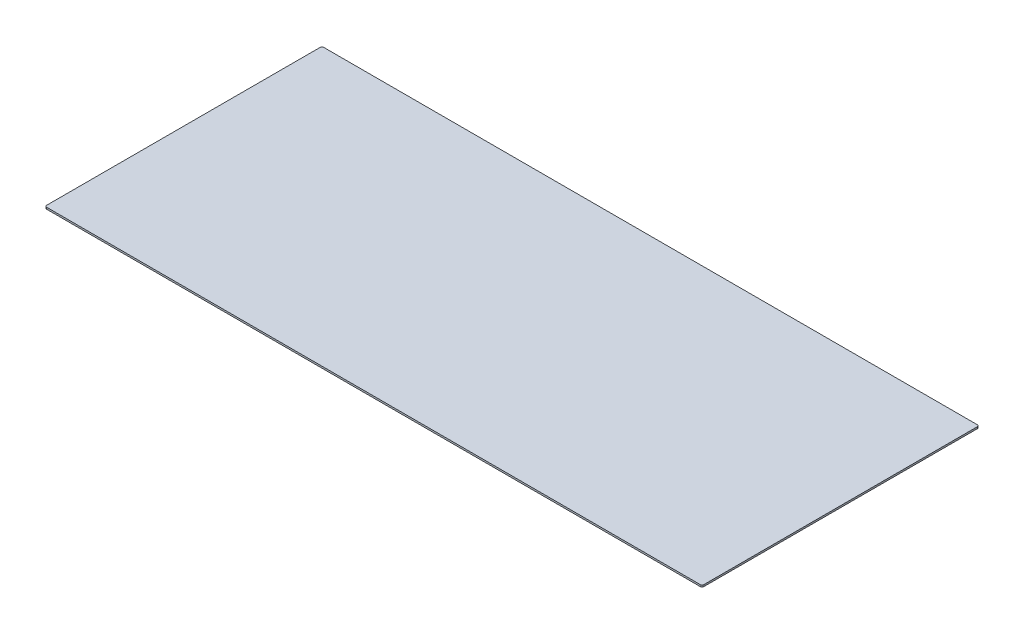
ISO-10303-21;
HEADER;
FILE_DESCRIPTION(('STEP AP214'),'2;1');
FILE_NAME('part.step','',(''),(''),'','','');
FILE_SCHEMA(('AUTOMOTIVE_DESIGN { 1 0 10303 214 1 1 1 1 }'));
ENDSEC;
DATA;
#1=APPLICATION_CONTEXT('core data for automotive mechanical design processes');
#2=APPLICATION_PROTOCOL_DEFINITION('international standard','automotive_design',2000,#1);
#3=PRODUCT_CONTEXT('',#1,'mechanical');
#4=PRODUCT('Part','Part','',(#3));
#5=PRODUCT_RELATED_PRODUCT_CATEGORY('part','',(#4));
#6=PRODUCT_DEFINITION_FORMATION('','',#4);
#7=PRODUCT_DEFINITION_CONTEXT('part definition',#1,'design');
#8=PRODUCT_DEFINITION('design','',#6,#7);
#9=PRODUCT_DEFINITION_SHAPE('','',#8);
#10=(LENGTH_UNIT() NAMED_UNIT(*) SI_UNIT(.MILLI.,.METRE.));
#11=(NAMED_UNIT(*) PLANE_ANGLE_UNIT() SI_UNIT($,.RADIAN.));
#12=(NAMED_UNIT(*) SI_UNIT($,.STERADIAN.) SOLID_ANGLE_UNIT());
#13=UNCERTAINTY_MEASURE_WITH_UNIT(LENGTH_MEASURE(1.E-05),#10,'distance_accuracy_value','');
#14=(GEOMETRIC_REPRESENTATION_CONTEXT(3) GLOBAL_UNCERTAINTY_ASSIGNED_CONTEXT((#13)) GLOBAL_UNIT_ASSIGNED_CONTEXT((#10,
#11,#12)) REPRESENTATION_CONTEXT('',''));
#15=CARTESIAN_POINT('',(0.,0.,0.));
#16=DIRECTION('',(0.,0.,1.));
#17=DIRECTION('',(1.,0.,0.));
#18=AXIS2_PLACEMENT_3D('',#15,#16,#17);
#19=CARTESIAN_POINT('',(587.375,3.175,-245.745));
#20=DIRECTION('',(0.,-1.,0.));
#21=DIRECTION('',(0.,0.,-1.));
#22=AXIS2_PLACEMENT_3D('',#19,#20,#21);
#23=CYLINDRICAL_SURFACE('',#22,3.17500000000003);
#24=CARTESIAN_POINT('',(587.375,0.,-245.745));
#25=DIRECTION('',(0.,1.,0.));
#26=DIRECTION('',(0.,0.,-1.));
#27=AXIS2_PLACEMENT_3D('',#24,#25,#26);
#28=CIRCLE('',#27,3.17500000000003);
#29=CARTESIAN_POINT('',(590.55,0.,-245.745));
#30=VERTEX_POINT('',#29);
#31=CARTESIAN_POINT('',(587.375,0.,-248.92));
#32=VERTEX_POINT('',#31);
#33=EDGE_CURVE('E133',#30,#32,#28,.T.);
#34=ORIENTED_EDGE('',*,*,#33,.T.);
#35=DIRECTION('',(0.,-1.,0.));
#36=VECTOR('',#35,1.);
#37=CARTESIAN_POINT('',(587.375,3.175,-248.92));
#38=LINE('',#37,#36);
#39=CARTESIAN_POINT('',(587.375,3.175,-248.92));
#40=VERTEX_POINT('',#39);
#41=EDGE_CURVE('E11',#40,#32,#38,.T.);
#42=ORIENTED_EDGE('',*,*,#41,.F.);
#43=CARTESIAN_POINT('',(587.375,3.175,-245.745));
#44=DIRECTION('',(0.,1.,0.));
#45=DIRECTION('',(0.,0.,-1.));
#46=AXIS2_PLACEMENT_3D('',#43,#44,#45);
#47=CIRCLE('',#46,3.17500000000003);
#48=CARTESIAN_POINT('',(590.55,3.175,-245.745));
#49=VERTEX_POINT('',#48);
#50=EDGE_CURVE('E147',#49,#40,#47,.T.);
#51=ORIENTED_EDGE('',*,*,#50,.F.);
#52=DIRECTION('',(0.,-1.,0.));
#53=VECTOR('',#52,1.);
#54=CARTESIAN_POINT('',(590.55,3.175,-245.745));
#55=LINE('',#54,#53);
#56=EDGE_CURVE('E129',#49,#30,#55,.T.);
#57=ORIENTED_EDGE('',*,*,#56,.T.);
#58=EDGE_LOOP('',(#34,#42,#51,#57));
#59=FACE_BOUND('',#58,.T.);
#60=ADVANCED_FACE('F37',(#59),#23,.T.);
#61=CARTESIAN_POINT('',(-587.375,3.175,-248.92));
#62=DIRECTION('',(0.,0.,1.));
#63=DIRECTION('',(1.,0.,0.));
#64=AXIS2_PLACEMENT_3D('',#61,#62,#63);
#65=PLANE('',#64);
#66=DIRECTION('',(-1.,0.,0.));
#67=VECTOR('',#66,1.);
#68=CARTESIAN_POINT('',(-587.375,0.,-248.92));
#69=LINE('',#68,#67);
#70=CARTESIAN_POINT('',(-587.375,0.,-248.92));
#71=VERTEX_POINT('',#70);
#72=EDGE_CURVE('E136',#32,#71,#69,.T.);
#73=ORIENTED_EDGE('',*,*,#72,.T.);
#74=DIRECTION('',(0.,-1.,0.));
#75=VECTOR('',#74,1.);
#76=CARTESIAN_POINT('',(-587.375,3.175,-248.92));
#77=LINE('',#76,#75);
#78=CARTESIAN_POINT('',(-587.375,3.175,-248.92));
#79=VERTEX_POINT('',#78);
#80=EDGE_CURVE('E45',#79,#71,#77,.T.);
#81=ORIENTED_EDGE('',*,*,#80,.F.);
#82=DIRECTION('',(-1.,0.,0.));
#83=VECTOR('',#82,1.);
#84=CARTESIAN_POINT('',(-587.375,3.175,-248.92));
#85=LINE('',#84,#83);
#86=EDGE_CURVE('E96',#40,#79,#85,.T.);
#87=ORIENTED_EDGE('',*,*,#86,.F.);
#88=ORIENTED_EDGE('',*,*,#41,.T.);
#89=EDGE_LOOP('',(#73,#81,#87,#88));
#90=FACE_BOUND('',#89,.T.);
#91=ADVANCED_FACE('F182',(#90),#65,.F.);
#92=CARTESIAN_POINT('',(-587.375,3.175,-245.745));
#93=DIRECTION('',(0.,-1.,0.));
#94=DIRECTION('',(0.,0.,-1.));
#95=AXIS2_PLACEMENT_3D('',#92,#93,#94);
#96=CYLINDRICAL_SURFACE('',#95,3.17500000000003);
#97=CARTESIAN_POINT('',(-587.375,0.,-245.745));
#98=DIRECTION('',(0.,1.,0.));
#99=DIRECTION('',(0.,0.,-1.));
#100=AXIS2_PLACEMENT_3D('',#97,#98,#99);
#101=CIRCLE('',#100,3.17500000000003);
#102=CARTESIAN_POINT('',(-590.55,0.,-245.745));
#103=VERTEX_POINT('',#102);
#104=EDGE_CURVE('E138',#71,#103,#101,.T.);
#105=ORIENTED_EDGE('',*,*,#104,.T.);
#106=DIRECTION('',(0.,-1.,0.));
#107=VECTOR('',#106,1.);
#108=CARTESIAN_POINT('',(-590.55,3.175,-245.745));
#109=LINE('',#108,#107);
#110=CARTESIAN_POINT('',(-590.55,3.175,-245.745));
#111=VERTEX_POINT('',#110);
#112=EDGE_CURVE('E154',#111,#103,#109,.T.);
#113=ORIENTED_EDGE('',*,*,#112,.F.);
#114=CARTESIAN_POINT('',(-587.375,3.175,-245.745));
#115=DIRECTION('',(0.,1.,0.));
#116=DIRECTION('',(0.,0.,-1.));
#117=AXIS2_PLACEMENT_3D('',#114,#115,#116);
#118=CIRCLE('',#117,3.17500000000003);
#119=EDGE_CURVE('E162',#79,#111,#118,.T.);
#120=ORIENTED_EDGE('',*,*,#119,.F.);
#121=ORIENTED_EDGE('',*,*,#80,.T.);
#122=EDGE_LOOP('',(#105,#113,#120,#121));
#123=FACE_BOUND('',#122,.T.);
#124=ADVANCED_FACE('F160',(#123),#96,.T.);
#125=CARTESIAN_POINT('',(-590.55,3.175,245.745));
#126=DIRECTION('',(1.,0.,0.));
#127=DIRECTION('',(0.,0.,-1.));
#128=AXIS2_PLACEMENT_3D('',#125,#126,#127);
#129=PLANE('',#128);
#130=DIRECTION('',(0.,0.,1.));
#131=VECTOR('',#130,1.);
#132=CARTESIAN_POINT('',(-590.55,0.,245.745));
#133=LINE('',#132,#131);
#134=CARTESIAN_POINT('',(-590.55,0.,245.745));
#135=VERTEX_POINT('',#134);
#136=EDGE_CURVE('E140',#103,#135,#133,.T.);
#137=ORIENTED_EDGE('',*,*,#136,.T.);
#138=DIRECTION('',(0.,-1.,0.));
#139=VECTOR('',#138,1.);
#140=CARTESIAN_POINT('',(-590.55,3.175,245.745));
#141=LINE('',#140,#139);
#142=CARTESIAN_POINT('',(-590.55,3.175,245.745));
#143=VERTEX_POINT('',#142);
#144=EDGE_CURVE('E151',#143,#135,#141,.T.);
#145=ORIENTED_EDGE('',*,*,#144,.F.);
#146=DIRECTION('',(0.,0.,1.));
#147=VECTOR('',#146,1.);
#148=CARTESIAN_POINT('',(-590.55,3.175,245.745));
#149=LINE('',#148,#147);
#150=EDGE_CURVE('E174',#111,#143,#149,.T.);
#151=ORIENTED_EDGE('',*,*,#150,.F.);
#152=ORIENTED_EDGE('',*,*,#112,.T.);
#153=EDGE_LOOP('',(#137,#145,#151,#152));
#154=FACE_BOUND('',#153,.T.);
#155=ADVANCED_FACE('F170',(#154),#129,.F.);
#156=CARTESIAN_POINT('',(-587.375,3.175,245.745));
#157=DIRECTION('',(0.,-1.,0.));
#158=DIRECTION('',(0.,0.,-1.));
#159=AXIS2_PLACEMENT_3D('',#156,#157,#158);
#160=CYLINDRICAL_SURFACE('',#159,3.17500000000003);
#161=CARTESIAN_POINT('',(-587.375,0.,245.745));
#162=DIRECTION('',(0.,1.,0.));
#163=DIRECTION('',(0.,0.,-1.));
#164=AXIS2_PLACEMENT_3D('',#161,#162,#163);
#165=CIRCLE('',#164,3.17500000000003);
#166=CARTESIAN_POINT('',(-587.375,0.,248.92));
#167=VERTEX_POINT('',#166);
#168=EDGE_CURVE('E142',#135,#167,#165,.T.);
#169=ORIENTED_EDGE('',*,*,#168,.T.);
#170=DIRECTION('',(0.,-1.,0.));
#171=VECTOR('',#170,1.);
#172=CARTESIAN_POINT('',(-587.375,3.175,248.92));
#173=LINE('',#172,#171);
#174=CARTESIAN_POINT('',(-587.375,3.175,248.92));
#175=VERTEX_POINT('',#174);
#176=EDGE_CURVE('E124',#175,#167,#173,.T.);
#177=ORIENTED_EDGE('',*,*,#176,.F.);
#178=CARTESIAN_POINT('',(-587.375,3.175,245.745));
#179=DIRECTION('',(0.,1.,0.));
#180=DIRECTION('',(0.,0.,-1.));
#181=AXIS2_PLACEMENT_3D('',#178,#179,#180);
#182=CIRCLE('',#181,3.17500000000003);
#183=EDGE_CURVE('E115',#143,#175,#182,.T.);
#184=ORIENTED_EDGE('',*,*,#183,.F.);
#185=ORIENTED_EDGE('',*,*,#144,.T.);
#186=EDGE_LOOP('',(#169,#177,#184,#185));
#187=FACE_BOUND('',#186,.T.);
#188=ADVANCED_FACE('F173',(#187),#160,.T.);
#189=CARTESIAN_POINT('',(-587.375,3.175,248.92));
#190=DIRECTION('',(0.,0.,-1.));
#191=DIRECTION('',(-1.,0.,0.));
#192=AXIS2_PLACEMENT_3D('',#189,#190,#191);
#193=PLANE('',#192);
#194=DIRECTION('',(1.,0.,0.));
#195=VECTOR('',#194,1.);
#196=CARTESIAN_POINT('',(-587.375,0.,248.92));
#197=LINE('',#196,#195);
#198=CARTESIAN_POINT('',(587.375,0.,248.92));
#199=VERTEX_POINT('',#198);
#200=EDGE_CURVE('E123',#167,#199,#197,.T.);
#201=ORIENTED_EDGE('',*,*,#200,.T.);
#202=DIRECTION('',(0.,-1.,0.));
#203=VECTOR('',#202,1.);
#204=CARTESIAN_POINT('',(587.375,3.175,248.92));
#205=LINE('',#204,#203);
#206=CARTESIAN_POINT('',(587.375,3.175,248.92));
#207=VERTEX_POINT('',#206);
#208=EDGE_CURVE('E120',#207,#199,#205,.T.);
#209=ORIENTED_EDGE('',*,*,#208,.F.);
#210=DIRECTION('',(1.,0.,0.));
#211=VECTOR('',#210,1.);
#212=CARTESIAN_POINT('',(-587.375,3.175,248.92));
#213=LINE('',#212,#211);
#214=EDGE_CURVE('E109',#175,#207,#213,.T.);
#215=ORIENTED_EDGE('',*,*,#214,.F.);
#216=ORIENTED_EDGE('',*,*,#176,.T.);
#217=EDGE_LOOP('',(#201,#209,#215,#216));
#218=FACE_BOUND('',#217,.T.);
#219=ADVANCED_FACE('F121',(#218),#193,.F.);
#220=CARTESIAN_POINT('',(587.375,3.175,245.745));
#221=DIRECTION('',(0.,-1.,0.));
#222=DIRECTION('',(0.,0.,-1.));
#223=AXIS2_PLACEMENT_3D('',#220,#221,#222);
#224=CYLINDRICAL_SURFACE('',#223,3.17500000000003);
#225=CARTESIAN_POINT('',(587.375,0.,245.745));
#226=DIRECTION('',(0.,1.,0.));
#227=DIRECTION('',(0.,0.,1.));
#228=AXIS2_PLACEMENT_3D('',#225,#226,#227);
#229=CIRCLE('',#228,3.17500000000003);
#230=CARTESIAN_POINT('',(590.55,0.,245.745));
#231=VERTEX_POINT('',#230);
#232=EDGE_CURVE('E82',#199,#231,#229,.T.);
#233=ORIENTED_EDGE('',*,*,#232,.T.);
#234=DIRECTION('',(0.,-1.,0.));
#235=VECTOR('',#234,1.);
#236=CARTESIAN_POINT('',(590.55,3.175,245.745));
#237=LINE('',#236,#235);
#238=CARTESIAN_POINT('',(590.55,3.175,245.745));
#239=VERTEX_POINT('',#238);
#240=EDGE_CURVE('E125',#239,#231,#237,.T.);
#241=ORIENTED_EDGE('',*,*,#240,.F.);
#242=CARTESIAN_POINT('',(587.375,3.175,245.745));
#243=DIRECTION('',(0.,1.,0.));
#244=DIRECTION('',(0.,0.,1.));
#245=AXIS2_PLACEMENT_3D('',#242,#243,#244);
#246=CIRCLE('',#245,3.17500000000003);
#247=EDGE_CURVE('E113',#207,#239,#246,.T.);
#248=ORIENTED_EDGE('',*,*,#247,.F.);
#249=ORIENTED_EDGE('',*,*,#208,.T.);
#250=EDGE_LOOP('',(#233,#241,#248,#249));
#251=FACE_BOUND('',#250,.T.);
#252=ADVANCED_FACE('F127',(#251),#224,.T.);
#253=CARTESIAN_POINT('',(590.55,3.175,245.745));
#254=DIRECTION('',(-1.,0.,0.));
#255=DIRECTION('',(0.,0.,1.));
#256=AXIS2_PLACEMENT_3D('',#253,#254,#255);
#257=PLANE('',#256);
#258=DIRECTION('',(0.,0.,-1.));
#259=VECTOR('',#258,1.);
#260=CARTESIAN_POINT('',(590.55,0.,245.745));
#261=LINE('',#260,#259);
#262=EDGE_CURVE('E88',#231,#30,#261,.T.);
#263=ORIENTED_EDGE('',*,*,#262,.T.);
#264=ORIENTED_EDGE('',*,*,#56,.F.);
#265=DIRECTION('',(0.,0.,-1.));
#266=VECTOR('',#265,1.);
#267=CARTESIAN_POINT('',(590.55,3.175,245.745));
#268=LINE('',#267,#266);
#269=EDGE_CURVE('E53',#239,#49,#268,.T.);
#270=ORIENTED_EDGE('',*,*,#269,.F.);
#271=ORIENTED_EDGE('',*,*,#240,.T.);
#272=EDGE_LOOP('',(#263,#264,#270,#271));
#273=FACE_BOUND('',#272,.T.);
#274=ADVANCED_FACE('F198',(#273),#257,.F.);
#275=CARTESIAN_POINT('',(587.375,3.175,-245.745));
#276=DIRECTION('',(0.,-1.,0.));
#277=DIRECTION('',(0.,0.,-1.));
#278=AXIS2_PLACEMENT_3D('',#275,#276,#277);
#279=PLANE('',#278);
#280=ORIENTED_EDGE('',*,*,#50,.T.);
#281=ORIENTED_EDGE('',*,*,#86,.T.);
#282=ORIENTED_EDGE('',*,*,#119,.T.);
#283=ORIENTED_EDGE('',*,*,#150,.T.);
#284=ORIENTED_EDGE('',*,*,#183,.T.);
#285=ORIENTED_EDGE('',*,*,#214,.T.);
#286=ORIENTED_EDGE('',*,*,#247,.T.);
#287=ORIENTED_EDGE('',*,*,#269,.T.);
#288=EDGE_LOOP('',(#280,#281,#282,#283,#284,#285,#286,#287));
#289=FACE_BOUND('',#288,.T.);
#290=ADVANCED_FACE('F111',(#289),#279,.F.);
#291=CARTESIAN_POINT('',(587.375,0.,-245.745));
#292=DIRECTION('',(0.,-1.,0.));
#293=DIRECTION('',(0.,0.,-1.));
#294=AXIS2_PLACEMENT_3D('',#291,#292,#293);
#295=PLANE('',#294);
#296=ORIENTED_EDGE('',*,*,#33,.F.);
#297=ORIENTED_EDGE('',*,*,#262,.F.);
#298=ORIENTED_EDGE('',*,*,#232,.F.);
#299=ORIENTED_EDGE('',*,*,#200,.F.);
#300=ORIENTED_EDGE('',*,*,#168,.F.);
#301=ORIENTED_EDGE('',*,*,#136,.F.);
#302=ORIENTED_EDGE('',*,*,#104,.F.);
#303=ORIENTED_EDGE('',*,*,#72,.F.);
#304=EDGE_LOOP('',(#296,#297,#298,#299,#300,#301,#302,#303));
#305=FACE_BOUND('',#304,.T.);
#306=ADVANCED_FACE('F166',(#305),#295,.T.);
#307=CLOSED_SHELL('',(#60,#91,#124,#155,#188,#219,#252,#274,#290,#306));
#308=MANIFOLD_SOLID_BREP('B2',#307);
#309=ADVANCED_BREP_SHAPE_REPRESENTATION('',(#18,#308),#14);
#310=SHAPE_DEFINITION_REPRESENTATION(#9,#309);
ENDSEC;
END-ISO-10303-21;
